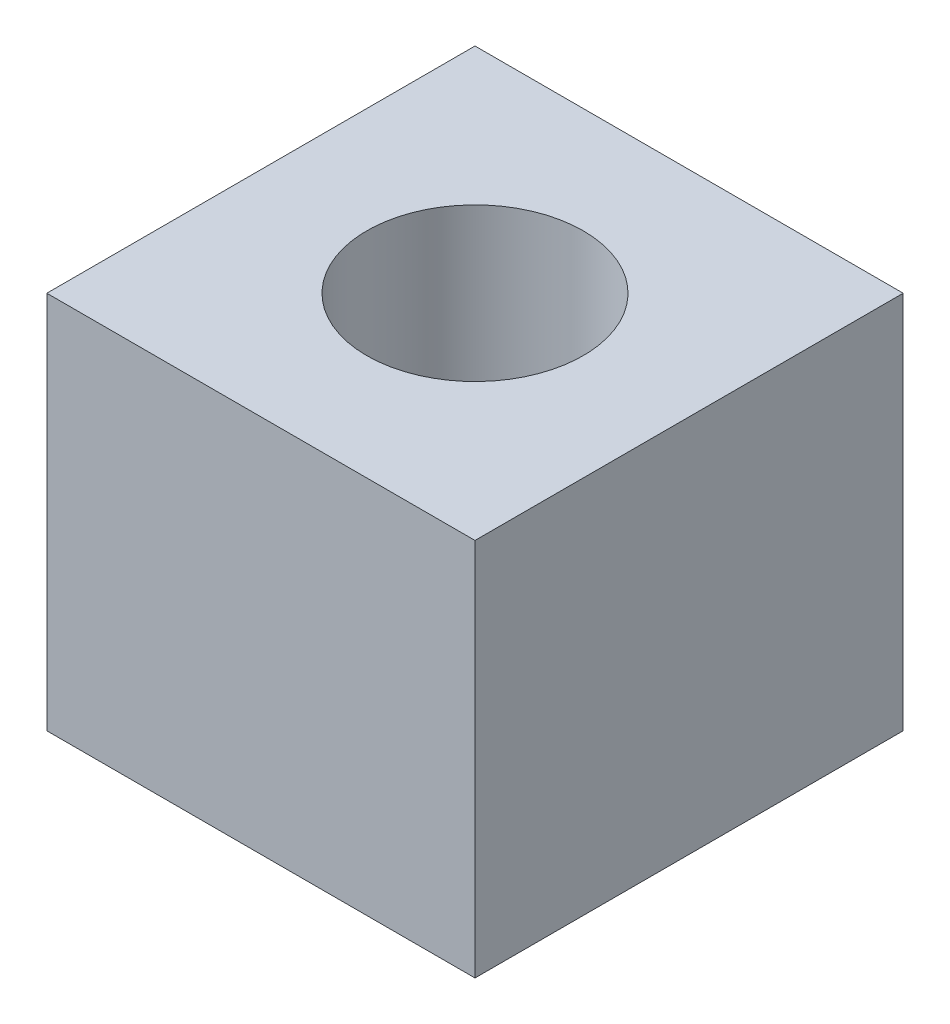
ISO-10303-21;
HEADER;
FILE_DESCRIPTION(('STEP AP214'),'2;1');
FILE_NAME('part.step','',(''),(''),'','','');
FILE_SCHEMA(('AUTOMOTIVE_DESIGN { 1 0 10303 214 1 1 1 1 }'));
ENDSEC;
DATA;
#1=APPLICATION_CONTEXT('core data for automotive mechanical design processes');
#2=APPLICATION_PROTOCOL_DEFINITION('international standard','automotive_design',2000,#1);
#3=PRODUCT_CONTEXT('',#1,'mechanical');
#4=PRODUCT('Part','Part','',(#3));
#5=PRODUCT_RELATED_PRODUCT_CATEGORY('part','',(#4));
#6=PRODUCT_DEFINITION_FORMATION('','',#4);
#7=PRODUCT_DEFINITION_CONTEXT('part definition',#1,'design');
#8=PRODUCT_DEFINITION('design','',#6,#7);
#9=PRODUCT_DEFINITION_SHAPE('','',#8);
#10=(LENGTH_UNIT() NAMED_UNIT(*) SI_UNIT(.MILLI.,.METRE.));
#11=(NAMED_UNIT(*) PLANE_ANGLE_UNIT() SI_UNIT($,.RADIAN.));
#12=(NAMED_UNIT(*) SI_UNIT($,.STERADIAN.) SOLID_ANGLE_UNIT());
#13=UNCERTAINTY_MEASURE_WITH_UNIT(LENGTH_MEASURE(1.E-05),#10,'distance_accuracy_value','');
#14=(GEOMETRIC_REPRESENTATION_CONTEXT(3) GLOBAL_UNCERTAINTY_ASSIGNED_CONTEXT((#13)) GLOBAL_UNIT_ASSIGNED_CONTEXT((#10,
#11,#12)) REPRESENTATION_CONTEXT('',''));
#15=CARTESIAN_POINT('',(0.,0.,0.));
#16=DIRECTION('',(0.,0.,1.));
#17=DIRECTION('',(1.,0.,0.));
#18=AXIS2_PLACEMENT_3D('',#15,#16,#17);
#19=CARTESIAN_POINT('',(0.,8.85,0.));
#20=DIRECTION('',(1.,0.,0.));
#21=DIRECTION('',(0.,0.,-1.));
#22=AXIS2_PLACEMENT_3D('',#19,#20,#21);
#23=PLANE('',#22);
#24=DIRECTION('',(0.,0.,1.));
#25=VECTOR('',#24,1.);
#26=CARTESIAN_POINT('',(0.,0.,0.));
#27=LINE('',#26,#25);
#28=CARTESIAN_POINT('',(0.,0.,-10.));
#29=VERTEX_POINT('',#28);
#30=CARTESIAN_POINT('',(0.,0.,0.));
#31=VERTEX_POINT('',#30);
#32=EDGE_CURVE('E100',#29,#31,#27,.T.);
#33=ORIENTED_EDGE('',*,*,#32,.T.);
#34=DIRECTION('',(0.,-1.,0.));
#35=VECTOR('',#34,1.);
#36=CARTESIAN_POINT('',(0.,8.85,0.));
#37=LINE('',#36,#35);
#38=CARTESIAN_POINT('',(0.,8.85,0.));
#39=VERTEX_POINT('',#38);
#40=EDGE_CURVE('E11',#39,#31,#37,.T.);
#41=ORIENTED_EDGE('',*,*,#40,.F.);
#42=DIRECTION('',(0.,0.,1.));
#43=VECTOR('',#42,1.);
#44=CARTESIAN_POINT('',(0.,8.85,0.));
#45=LINE('',#44,#43);
#46=CARTESIAN_POINT('',(0.,8.85,-10.));
#47=VERTEX_POINT('',#46);
#48=EDGE_CURVE('E88',#47,#39,#45,.T.);
#49=ORIENTED_EDGE('',*,*,#48,.F.);
#50=DIRECTION('',(0.,-1.,0.));
#51=VECTOR('',#50,1.);
#52=CARTESIAN_POINT('',(0.,8.85,-10.));
#53=LINE('',#52,#51);
#54=EDGE_CURVE('E96',#47,#29,#53,.T.);
#55=ORIENTED_EDGE('',*,*,#54,.T.);
#56=EDGE_LOOP('',(#33,#41,#49,#55));
#57=FACE_BOUND('',#56,.T.);
#58=ADVANCED_FACE('F37',(#57),#23,.F.);
#59=CARTESIAN_POINT('',(0.,8.85,0.));
#60=DIRECTION('',(0.,0.,-1.));
#61=DIRECTION('',(-1.,0.,0.));
#62=AXIS2_PLACEMENT_3D('',#59,#60,#61);
#63=PLANE('',#62);
#64=DIRECTION('',(1.,0.,0.));
#65=VECTOR('',#64,1.);
#66=CARTESIAN_POINT('',(0.,0.,0.));
#67=LINE('',#66,#65);
#68=CARTESIAN_POINT('',(10.,0.,0.));
#69=VERTEX_POINT('',#68);
#70=EDGE_CURVE('E92',#31,#69,#67,.T.);
#71=ORIENTED_EDGE('',*,*,#70,.T.);
#72=DIRECTION('',(0.,-1.,0.));
#73=VECTOR('',#72,1.);
#74=CARTESIAN_POINT('',(10.,8.85,0.));
#75=LINE('',#74,#73);
#76=CARTESIAN_POINT('',(10.,8.85,0.));
#77=VERTEX_POINT('',#76);
#78=EDGE_CURVE('E45',#77,#69,#75,.T.);
#79=ORIENTED_EDGE('',*,*,#78,.F.);
#80=DIRECTION('',(1.,0.,0.));
#81=VECTOR('',#80,1.);
#82=CARTESIAN_POINT('',(0.,8.85,0.));
#83=LINE('',#82,#81);
#84=EDGE_CURVE('E83',#39,#77,#83,.T.);
#85=ORIENTED_EDGE('',*,*,#84,.F.);
#86=ORIENTED_EDGE('',*,*,#40,.T.);
#87=EDGE_LOOP('',(#71,#79,#85,#86));
#88=FACE_BOUND('',#87,.T.);
#89=ADVANCED_FACE('F91',(#88),#63,.F.);
#90=CARTESIAN_POINT('',(10.,8.85,0.));
#91=DIRECTION('',(-1.,0.,0.));
#92=DIRECTION('',(0.,0.,1.));
#93=AXIS2_PLACEMENT_3D('',#90,#91,#92);
#94=PLANE('',#93);
#95=DIRECTION('',(0.,0.,-1.));
#96=VECTOR('',#95,1.);
#97=CARTESIAN_POINT('',(10.,0.,0.));
#98=LINE('',#97,#96);
#99=CARTESIAN_POINT('',(10.,0.,-10.));
#100=VERTEX_POINT('',#99);
#101=EDGE_CURVE('E70',#69,#100,#98,.T.);
#102=ORIENTED_EDGE('',*,*,#101,.T.);
#103=DIRECTION('',(0.,-1.,0.));
#104=VECTOR('',#103,1.);
#105=CARTESIAN_POINT('',(10.,8.85,-10.));
#106=LINE('',#105,#104);
#107=CARTESIAN_POINT('',(10.,8.85,-10.));
#108=VERTEX_POINT('',#107);
#109=EDGE_CURVE('E93',#108,#100,#106,.T.);
#110=ORIENTED_EDGE('',*,*,#109,.F.);
#111=DIRECTION('',(0.,0.,-1.));
#112=VECTOR('',#111,1.);
#113=CARTESIAN_POINT('',(10.,8.85,0.));
#114=LINE('',#113,#112);
#115=EDGE_CURVE('E86',#77,#108,#114,.T.);
#116=ORIENTED_EDGE('',*,*,#115,.F.);
#117=ORIENTED_EDGE('',*,*,#78,.T.);
#118=EDGE_LOOP('',(#102,#110,#116,#117));
#119=FACE_BOUND('',#118,.T.);
#120=ADVANCED_FACE('F94',(#119),#94,.F.);
#121=CARTESIAN_POINT('',(0.,8.85,-10.));
#122=DIRECTION('',(0.,0.,1.));
#123=DIRECTION('',(1.,0.,0.));
#124=AXIS2_PLACEMENT_3D('',#121,#122,#123);
#125=PLANE('',#124);
#126=DIRECTION('',(-1.,0.,0.));
#127=VECTOR('',#126,1.);
#128=CARTESIAN_POINT('',(0.,0.,-10.));
#129=LINE('',#128,#127);
#130=EDGE_CURVE('E76',#100,#29,#129,.T.);
#131=ORIENTED_EDGE('',*,*,#130,.T.);
#132=ORIENTED_EDGE('',*,*,#54,.F.);
#133=DIRECTION('',(-1.,0.,0.));
#134=VECTOR('',#133,1.);
#135=CARTESIAN_POINT('',(0.,8.85,-10.));
#136=LINE('',#135,#134);
#137=EDGE_CURVE('E53',#108,#47,#136,.T.);
#138=ORIENTED_EDGE('',*,*,#137,.F.);
#139=ORIENTED_EDGE('',*,*,#109,.T.);
#140=EDGE_LOOP('',(#131,#132,#138,#139));
#141=FACE_BOUND('',#140,.T.);
#142=ADVANCED_FACE('F108',(#141),#125,.F.);
#143=CARTESIAN_POINT('',(0.,8.85,0.));
#144=DIRECTION('',(0.,-1.,0.));
#145=DIRECTION('',(0.,0.,-1.));
#146=AXIS2_PLACEMENT_3D('',#143,#144,#145);
#147=PLANE('',#146);
#148=CARTESIAN_POINT('',(5.,8.85,-5.));
#149=DIRECTION('',(0.,1.,0.));
#150=DIRECTION('',(0.,0.,1.));
#151=AXIS2_PLACEMENT_3D('',#148,#149,#150);
#152=CIRCLE('',#151,2.5273);
#153=CARTESIAN_POINT('',(5.,8.85,-2.4727));
#154=VERTEX_POINT('',#153);
#155=EDGE_CURVE('E114',#154,#154,#152,.T.);
#156=ORIENTED_EDGE('',*,*,#155,.F.);
#157=EDGE_LOOP('',(#156));
#158=FACE_BOUND('',#157,.T.);
#159=ORIENTED_EDGE('',*,*,#48,.T.);
#160=ORIENTED_EDGE('',*,*,#84,.T.);
#161=ORIENTED_EDGE('',*,*,#115,.T.);
#162=ORIENTED_EDGE('',*,*,#137,.T.);
#163=EDGE_LOOP('',(#159,#160,#161,#162));
#164=FACE_BOUND('',#163,.T.);
#165=ADVANCED_FACE('F84',(#158,#164),#147,.F.);
#166=CARTESIAN_POINT('',(0.,0.,0.));
#167=DIRECTION('',(0.,-1.,0.));
#168=DIRECTION('',(0.,0.,-1.));
#169=AXIS2_PLACEMENT_3D('',#166,#167,#168);
#170=PLANE('',#169);
#171=ORIENTED_EDGE('',*,*,#32,.F.);
#172=ORIENTED_EDGE('',*,*,#130,.F.);
#173=ORIENTED_EDGE('',*,*,#101,.F.);
#174=ORIENTED_EDGE('',*,*,#70,.F.);
#175=EDGE_LOOP('',(#171,#172,#173,#174));
#176=FACE_BOUND('',#175,.T.);
#177=ADVANCED_FACE('F111',(#176),#170,.T.);
#178=CARTESIAN_POINT('',(5.,4.85,-5.));
#179=DIRECTION('',(0.,1.,0.));
#180=DIRECTION('',(0.,0.,1.));
#181=AXIS2_PLACEMENT_3D('',#178,#179,#180);
#182=CYLINDRICAL_SURFACE('',#181,2.5273);
#183=CARTESIAN_POINT('',(5.,4.85,-5.));
#184=DIRECTION('',(0.,1.,0.));
#185=DIRECTION('',(0.,0.,1.));
#186=AXIS2_PLACEMENT_3D('',#183,#184,#185);
#187=CIRCLE('',#186,2.5273);
#188=CARTESIAN_POINT('',(5.,4.85,-2.4727));
#189=VERTEX_POINT('',#188);
#190=EDGE_CURVE('E103',#189,#189,#187,.T.);
#191=ORIENTED_EDGE('',*,*,#190,.F.);
#192=EDGE_LOOP('',(#191));
#193=FACE_BOUND('',#192,.T.);
#194=ORIENTED_EDGE('',*,*,#155,.T.);
#195=EDGE_LOOP('',(#194));
#196=FACE_BOUND('',#195,.T.);
#197=ADVANCED_FACE('F122',(#193,#196),#182,.F.);
#198=CARTESIAN_POINT('',(5.,4.85,-5.));
#199=DIRECTION('',(0.,1.,0.));
#200=DIRECTION('',(0.,0.,1.));
#201=AXIS2_PLACEMENT_3D('',#198,#199,#200);
#202=PLANE('',#201);
#203=ORIENTED_EDGE('',*,*,#190,.T.);
#204=EDGE_LOOP('',(#203));
#205=FACE_BOUND('',#204,.T.);
#206=ADVANCED_FACE('F120',(#205),#202,.T.);
#207=CLOSED_SHELL('',(#58,#89,#120,#142,#165,#177,#197,#206));
#208=MANIFOLD_SOLID_BREP('B2',#207);
#209=ADVANCED_BREP_SHAPE_REPRESENTATION('',(#18,#208),#14);
#210=SHAPE_DEFINITION_REPRESENTATION(#9,#209);
ENDSEC;
END-ISO-10303-21;
